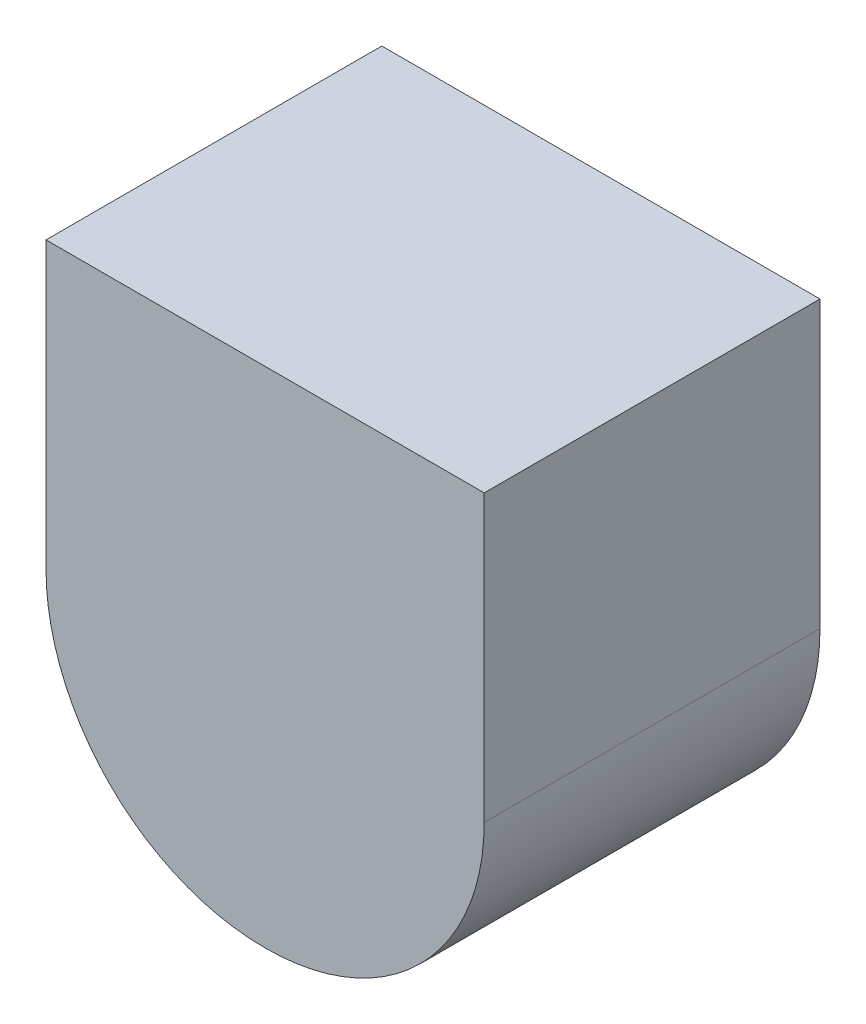
ISO-10303-21;
HEADER;
FILE_DESCRIPTION(('STEP AP214'),'2;1');
FILE_NAME('part.step','',(''),(''),'','','');
FILE_SCHEMA(('AUTOMOTIVE_DESIGN { 1 0 10303 214 1 1 1 1 }'));
ENDSEC;
DATA;
#1=APPLICATION_CONTEXT('core data for automotive mechanical design processes');
#2=APPLICATION_PROTOCOL_DEFINITION('international standard','automotive_design',2000,#1);
#3=PRODUCT_CONTEXT('',#1,'mechanical');
#4=PRODUCT('Part','Part','',(#3));
#5=PRODUCT_RELATED_PRODUCT_CATEGORY('part','',(#4));
#6=PRODUCT_DEFINITION_FORMATION('','',#4);
#7=PRODUCT_DEFINITION_CONTEXT('part definition',#1,'design');
#8=PRODUCT_DEFINITION('design','',#6,#7);
#9=PRODUCT_DEFINITION_SHAPE('','',#8);
#10=(LENGTH_UNIT() NAMED_UNIT(*) SI_UNIT(.MILLI.,.METRE.));
#11=(NAMED_UNIT(*) PLANE_ANGLE_UNIT() SI_UNIT($,.RADIAN.));
#12=(NAMED_UNIT(*) SI_UNIT($,.STERADIAN.) SOLID_ANGLE_UNIT());
#13=UNCERTAINTY_MEASURE_WITH_UNIT(LENGTH_MEASURE(1.E-05),#10,'distance_accuracy_value','');
#14=(GEOMETRIC_REPRESENTATION_CONTEXT(3) GLOBAL_UNCERTAINTY_ASSIGNED_CONTEXT((#13)) GLOBAL_UNIT_ASSIGNED_CONTEXT((#10,
#11,#12)) REPRESENTATION_CONTEXT('',''));
#15=CARTESIAN_POINT('',(0.,0.,0.));
#16=DIRECTION('',(0.,0.,1.));
#17=DIRECTION('',(1.,0.,0.));
#18=AXIS2_PLACEMENT_3D('',#15,#16,#17);
#19=CARTESIAN_POINT('',(1.13050066,2.99999908,0.1999996));
#20=DIRECTION('',(0.,0.,-1.));
#21=DIRECTION('',(-1.,0.,0.));
#22=AXIS2_PLACEMENT_3D('',#19,#20,#21);
#23=PLANE('',#22);
#24=DIRECTION('',(-1.,0.,0.));
#25=VECTOR('',#24,1.);
#26=CARTESIAN_POINT('',(0.86950042,2.69999968,0.1999996));
#27=LINE('',#26,#25);
#28=CARTESIAN_POINT('',(1.00050066,2.69999968,0.1999996));
#29=VERTEX_POINT('',#28);
#30=CARTESIAN_POINT('',(0.99950042,2.69999968,0.1999996));
#31=VERTEX_POINT('',#30);
#32=EDGE_CURVE('E11',#29,#31,#27,.T.);
#33=ORIENTED_EDGE('',*,*,#32,.F.);
#34=CARTESIAN_POINT('',(1.00050066,2.82999968,0.1999996));
#35=DIRECTION('',(0.,0.,-1.));
#36=DIRECTION('',(1.,0.,0.));
#37=AXIS2_PLACEMENT_3D('',#34,#35,#36);
#38=CIRCLE('',#37,0.13);
#39=CARTESIAN_POINT('',(1.13050066,2.82999968,0.1999996));
#40=VERTEX_POINT('',#39);
#41=EDGE_CURVE('E24',#40,#29,#38,.T.);
#42=ORIENTED_EDGE('',*,*,#41,.F.);
#43=DIRECTION('',(0.,-1.,0.));
#44=VECTOR('',#43,1.);
#45=CARTESIAN_POINT('',(1.13050066,2.99999908,0.1999996));
#46=LINE('',#45,#44);
#47=CARTESIAN_POINT('',(1.13050066,2.99999908,0.1999996));
#48=VERTEX_POINT('',#47);
#49=EDGE_CURVE('E117',#48,#40,#46,.T.);
#50=ORIENTED_EDGE('',*,*,#49,.F.);
#51=DIRECTION('',(1.,0.,0.));
#52=VECTOR('',#51,1.);
#53=CARTESIAN_POINT('',(1.13050066,2.99999908,0.1999996));
#54=LINE('',#53,#52);
#55=CARTESIAN_POINT('',(0.86950042,2.99999908,0.1999996));
#56=VERTEX_POINT('',#55);
#57=EDGE_CURVE('E115',#56,#48,#54,.T.);
#58=ORIENTED_EDGE('',*,*,#57,.F.);
#59=DIRECTION('',(0.,1.,0.));
#60=VECTOR('',#59,1.);
#61=CARTESIAN_POINT('',(0.86950042,2.99999908,0.1999996));
#62=LINE('',#61,#60);
#63=CARTESIAN_POINT('',(0.86950042,2.82999968,0.1999996));
#64=VERTEX_POINT('',#63);
#65=EDGE_CURVE('E73',#64,#56,#62,.T.);
#66=ORIENTED_EDGE('',*,*,#65,.F.);
#67=CARTESIAN_POINT('',(0.99950042,2.82999968,0.1999996));
#68=DIRECTION('',(0.,0.,-1.));
#69=DIRECTION('',(1.,0.,0.));
#70=AXIS2_PLACEMENT_3D('',#67,#68,#69);
#71=CIRCLE('',#70,0.13);
#72=EDGE_CURVE('E111',#31,#64,#71,.T.);
#73=ORIENTED_EDGE('',*,*,#72,.F.);
#74=EDGE_LOOP('',(#33,#42,#50,#58,#66,#73));
#75=FACE_BOUND('',#74,.T.);
#76=ADVANCED_FACE('F17',(#75),#23,.F.);
#77=CARTESIAN_POINT('',(0.99950042,2.82999968,0.));
#78=DIRECTION('',(0.,0.,1.));
#79=DIRECTION('',(1.,0.,0.));
#80=AXIS2_PLACEMENT_3D('',#77,#78,#79);
#81=CYLINDRICAL_SURFACE('',#80,0.13);
#82=ORIENTED_EDGE('',*,*,#72,.T.);
#83=DIRECTION('',(0.,0.,-1.));
#84=VECTOR('',#83,1.);
#85=CARTESIAN_POINT('',(0.86950042,2.82999968,0.));
#86=LINE('',#85,#84);
#87=CARTESIAN_POINT('',(0.86950042,2.82999968,0.));
#88=VERTEX_POINT('',#87);
#89=EDGE_CURVE('E109',#64,#88,#86,.T.);
#90=ORIENTED_EDGE('',*,*,#89,.T.);
#91=CARTESIAN_POINT('',(0.99950042,2.82999968,0.));
#92=DIRECTION('',(0.,0.,1.));
#93=DIRECTION('',(1.,0.,0.));
#94=AXIS2_PLACEMENT_3D('',#91,#92,#93);
#95=CIRCLE('',#94,0.13);
#96=CARTESIAN_POINT('',(0.99950042,2.69999968,0.));
#97=VERTEX_POINT('',#96);
#98=EDGE_CURVE('E89',#88,#97,#95,.T.);
#99=ORIENTED_EDGE('',*,*,#98,.T.);
#100=DIRECTION('',(0.,0.,1.));
#101=VECTOR('',#100,1.);
#102=CARTESIAN_POINT('',(0.99950042,2.69999968,0.));
#103=LINE('',#102,#101);
#104=EDGE_CURVE('E105',#97,#31,#103,.T.);
#105=ORIENTED_EDGE('',*,*,#104,.T.);
#106=EDGE_LOOP('',(#82,#90,#99,#105));
#107=FACE_BOUND('',#106,.T.);
#108=ADVANCED_FACE('F127',(#107),#81,.T.);
#109=CARTESIAN_POINT('',(0.86950042,2.69999968,0.));
#110=DIRECTION('',(0.,1.,0.));
#111=DIRECTION('',(-1.,0.,0.));
#112=AXIS2_PLACEMENT_3D('',#109,#110,#111);
#113=PLANE('',#112);
#114=DIRECTION('',(-1.,0.,0.));
#115=VECTOR('',#114,1.);
#116=CARTESIAN_POINT('',(1.13050066,2.69999968,0.));
#117=LINE('',#116,#115);
#118=CARTESIAN_POINT('',(1.00050066,2.69999968,0.));
#119=VERTEX_POINT('',#118);
#120=EDGE_CURVE('E103',#119,#97,#117,.T.);
#121=ORIENTED_EDGE('',*,*,#120,.F.);
#122=DIRECTION('',(0.,0.,-1.));
#123=VECTOR('',#122,1.);
#124=CARTESIAN_POINT('',(1.00050066,2.69999968,0.));
#125=LINE('',#124,#123);
#126=EDGE_CURVE('E100',#29,#119,#125,.T.);
#127=ORIENTED_EDGE('',*,*,#126,.F.);
#128=ORIENTED_EDGE('',*,*,#32,.T.);
#129=ORIENTED_EDGE('',*,*,#104,.F.);
#130=EDGE_LOOP('',(#121,#127,#128,#129));
#131=FACE_BOUND('',#130,.T.);
#132=ADVANCED_FACE('F123',(#131),#113,.F.);
#133=CARTESIAN_POINT('',(1.00050066,2.82999968,0.));
#134=DIRECTION('',(0.,0.,1.));
#135=DIRECTION('',(1.,0.,0.));
#136=AXIS2_PLACEMENT_3D('',#133,#134,#135);
#137=CYLINDRICAL_SURFACE('',#136,0.13);
#138=ORIENTED_EDGE('',*,*,#41,.T.);
#139=ORIENTED_EDGE('',*,*,#126,.T.);
#140=CARTESIAN_POINT('',(1.00050066,2.82999968,0.));
#141=DIRECTION('',(0.,0.,1.));
#142=DIRECTION('',(1.,0.,0.));
#143=AXIS2_PLACEMENT_3D('',#140,#141,#142);
#144=CIRCLE('',#143,0.13);
#145=CARTESIAN_POINT('',(1.13050066,2.82999968,0.));
#146=VERTEX_POINT('',#145);
#147=EDGE_CURVE('E98',#119,#146,#144,.T.);
#148=ORIENTED_EDGE('',*,*,#147,.T.);
#149=DIRECTION('',(0.,0.,1.));
#150=VECTOR('',#149,1.);
#151=CARTESIAN_POINT('',(1.13050066,2.82999968,0.));
#152=LINE('',#151,#150);
#153=EDGE_CURVE('E95',#146,#40,#152,.T.);
#154=ORIENTED_EDGE('',*,*,#153,.T.);
#155=EDGE_LOOP('',(#138,#139,#148,#154));
#156=FACE_BOUND('',#155,.T.);
#157=ADVANCED_FACE('F120',(#156),#137,.T.);
#158=CARTESIAN_POINT('',(1.13050066,2.69999968,0.));
#159=DIRECTION('',(-1.,0.,0.));
#160=DIRECTION('',(0.,-1.,0.));
#161=AXIS2_PLACEMENT_3D('',#158,#159,#160);
#162=PLANE('',#161);
#163=DIRECTION('',(0.,-1.,0.));
#164=VECTOR('',#163,1.);
#165=CARTESIAN_POINT('',(1.13050066,2.69999968,0.));
#166=LINE('',#165,#164);
#167=CARTESIAN_POINT('',(1.13050066,2.99999908,0.));
#168=VERTEX_POINT('',#167);
#169=EDGE_CURVE('E93',#168,#146,#166,.T.);
#170=ORIENTED_EDGE('',*,*,#169,.F.);
#171=DIRECTION('',(0.,0.,-1.));
#172=VECTOR('',#171,1.);
#173=CARTESIAN_POINT('',(1.13050066,2.99999908,0.));
#174=LINE('',#173,#172);
#175=EDGE_CURVE('E76',#48,#168,#174,.T.);
#176=ORIENTED_EDGE('',*,*,#175,.F.);
#177=ORIENTED_EDGE('',*,*,#49,.T.);
#178=ORIENTED_EDGE('',*,*,#153,.F.);
#179=EDGE_LOOP('',(#170,#176,#177,#178));
#180=FACE_BOUND('',#179,.T.);
#181=ADVANCED_FACE('F125',(#180),#162,.F.);
#182=CARTESIAN_POINT('',(1.13050066,2.99999908,0.));
#183=DIRECTION('',(0.,-1.,0.));
#184=DIRECTION('',(1.,0.,0.));
#185=AXIS2_PLACEMENT_3D('',#182,#183,#184);
#186=PLANE('',#185);
#187=DIRECTION('',(0.,0.,-1.));
#188=VECTOR('',#187,1.);
#189=CARTESIAN_POINT('',(0.86950042,2.99999908,0.));
#190=LINE('',#189,#188);
#191=CARTESIAN_POINT('',(0.86950042,2.99999908,0.));
#192=VERTEX_POINT('',#191);
#193=EDGE_CURVE('E67',#56,#192,#190,.T.);
#194=ORIENTED_EDGE('',*,*,#193,.F.);
#195=ORIENTED_EDGE('',*,*,#57,.T.);
#196=ORIENTED_EDGE('',*,*,#175,.T.);
#197=DIRECTION('',(1.,0.,0.));
#198=VECTOR('',#197,1.);
#199=CARTESIAN_POINT('',(1.13050066,2.99999908,0.));
#200=LINE('',#199,#198);
#201=EDGE_CURVE('E77',#192,#168,#200,.T.);
#202=ORIENTED_EDGE('',*,*,#201,.F.);
#203=EDGE_LOOP('',(#194,#195,#196,#202));
#204=FACE_BOUND('',#203,.T.);
#205=ADVANCED_FACE('F81',(#204),#186,.F.);
#206=CARTESIAN_POINT('',(0.86950042,2.99999908,0.));
#207=DIRECTION('',(1.,0.,0.));
#208=DIRECTION('',(0.,1.,0.));
#209=AXIS2_PLACEMENT_3D('',#206,#207,#208);
#210=PLANE('',#209);
#211=DIRECTION('',(0.,1.,0.));
#212=VECTOR('',#211,1.);
#213=CARTESIAN_POINT('',(0.86950042,2.99999908,0.));
#214=LINE('',#213,#212);
#215=EDGE_CURVE('E72',#88,#192,#214,.T.);
#216=ORIENTED_EDGE('',*,*,#215,.F.);
#217=ORIENTED_EDGE('',*,*,#89,.F.);
#218=ORIENTED_EDGE('',*,*,#65,.T.);
#219=ORIENTED_EDGE('',*,*,#193,.T.);
#220=EDGE_LOOP('',(#216,#217,#218,#219));
#221=FACE_BOUND('',#220,.T.);
#222=ADVANCED_FACE('F69',(#221),#210,.F.);
#223=CARTESIAN_POINT('',(1.13050066,2.99999908,0.));
#224=DIRECTION('',(0.,0.,-1.));
#225=DIRECTION('',(-1.,0.,0.));
#226=AXIS2_PLACEMENT_3D('',#223,#224,#225);
#227=PLANE('',#226);
#228=ORIENTED_EDGE('',*,*,#120,.T.);
#229=ORIENTED_EDGE('',*,*,#98,.F.);
#230=ORIENTED_EDGE('',*,*,#215,.T.);
#231=ORIENTED_EDGE('',*,*,#201,.T.);
#232=ORIENTED_EDGE('',*,*,#169,.T.);
#233=ORIENTED_EDGE('',*,*,#147,.F.);
#234=EDGE_LOOP('',(#228,#229,#230,#231,#232,#233));
#235=FACE_BOUND('',#234,.T.);
#236=ADVANCED_FACE('F88',(#235),#227,.T.);
#237=CLOSED_SHELL('',(#76,#108,#132,#157,#181,#205,#222,#236));
#238=MANIFOLD_SOLID_BREP('B1',#237);
#239=ADVANCED_BREP_SHAPE_REPRESENTATION('',(#18,#238),#14);
#240=SHAPE_DEFINITION_REPRESENTATION(#9,#239);
ENDSEC;
END-ISO-10303-21;
